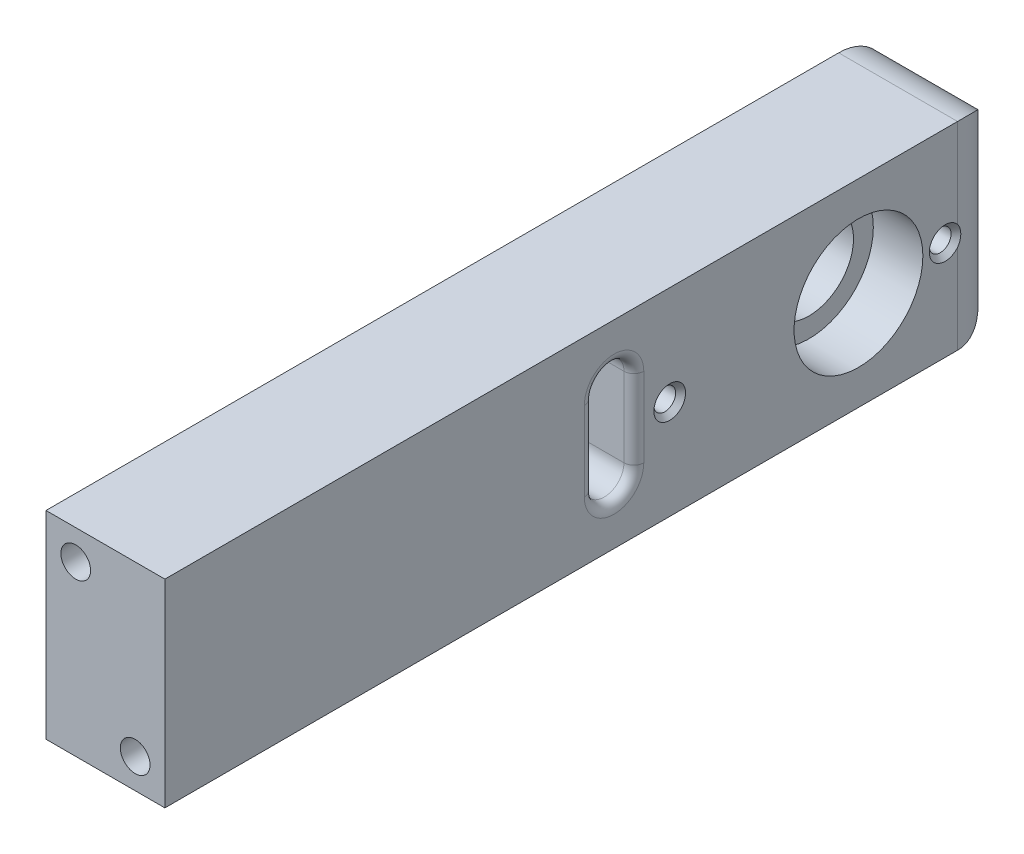
ISO-10303-21;
HEADER;
FILE_DESCRIPTION(('STEP AP214'),'2;1');
FILE_NAME('part.step','',(''),(''),'','','');
FILE_SCHEMA(('AUTOMOTIVE_DESIGN { 1 0 10303 214 1 1 1 1 }'));
ENDSEC;
DATA;
#1=APPLICATION_CONTEXT('core data for automotive mechanical design processes');
#2=APPLICATION_PROTOCOL_DEFINITION('international standard','automotive_design',2000,#1);
#3=PRODUCT_CONTEXT('',#1,'mechanical');
#4=PRODUCT('Part','Part','',(#3));
#5=PRODUCT_RELATED_PRODUCT_CATEGORY('part','',(#4));
#6=PRODUCT_DEFINITION_FORMATION('','',#4);
#7=PRODUCT_DEFINITION_CONTEXT('part definition',#1,'design');
#8=PRODUCT_DEFINITION('design','',#6,#7);
#9=PRODUCT_DEFINITION_SHAPE('','',#8);
#10=(LENGTH_UNIT() NAMED_UNIT(*) SI_UNIT(.MILLI.,.METRE.));
#11=(NAMED_UNIT(*) PLANE_ANGLE_UNIT() SI_UNIT($,.RADIAN.));
#12=(NAMED_UNIT(*) SI_UNIT($,.STERADIAN.) SOLID_ANGLE_UNIT());
#13=UNCERTAINTY_MEASURE_WITH_UNIT(LENGTH_MEASURE(1.E-05),#10,'distance_accuracy_value','');
#14=(GEOMETRIC_REPRESENTATION_CONTEXT(3) GLOBAL_UNCERTAINTY_ASSIGNED_CONTEXT((#13)) GLOBAL_UNIT_ASSIGNED_CONTEXT((#10,
#11,#12)) REPRESENTATION_CONTEXT('',''));
#15=CARTESIAN_POINT('',(0.,0.,0.));
#16=DIRECTION('',(0.,0.,1.));
#17=DIRECTION('',(1.,0.,0.));
#18=AXIS2_PLACEMENT_3D('',#15,#16,#17);
#19=CARTESIAN_POINT('',(6.,-10.,85.));
#20=DIRECTION('',(-1.,0.,0.));
#21=DIRECTION('',(0.,0.,1.));
#22=AXIS2_PLACEMENT_3D('',#19,#20,#21);
#23=PLANE('',#22);
#24=DIRECTION('',(0.,1.,0.));
#25=VECTOR('',#24,1.);
#26=CARTESIAN_POINT('',(6.,-10.,42.6680373510065));
#27=LINE('',#26,#25);
#28=CARTESIAN_POINT('',(6.,-4.,42.6680373510065));
#29=VERTEX_POINT('',#28);
#30=CARTESIAN_POINT('',(6.,4.,42.6680373510065));
#31=VERTEX_POINT('',#30);
#32=EDGE_CURVE('E50',#29,#31,#27,.T.);
#33=ORIENTED_EDGE('',*,*,#32,.T.);
#34=CARTESIAN_POINT('',(6.,4.,39.6680373510065));
#35=DIRECTION('',(-1.,0.,0.));
#36=DIRECTION('',(0.,0.,1.));
#37=AXIS2_PLACEMENT_3D('',#34,#35,#36);
#38=CIRCLE('',#37,3.);
#39=CARTESIAN_POINT('',(6.,4.,36.6680373510065));
#40=VERTEX_POINT('',#39);
#41=EDGE_CURVE('E355',#31,#40,#38,.T.);
#42=ORIENTED_EDGE('',*,*,#41,.T.);
#43=DIRECTION('',(0.,-1.,0.));
#44=VECTOR('',#43,1.);
#45=CARTESIAN_POINT('',(6.,-10.,36.6680373510065));
#46=LINE('',#45,#44);
#47=CARTESIAN_POINT('',(6.,-4.,36.6680373510065));
#48=VERTEX_POINT('',#47);
#49=EDGE_CURVE('E351',#40,#48,#46,.T.);
#50=ORIENTED_EDGE('',*,*,#49,.T.);
#51=CARTESIAN_POINT('',(6.,-4.,39.6680373510065));
#52=DIRECTION('',(-1.,0.,0.));
#53=DIRECTION('',(0.,0.,1.));
#54=AXIS2_PLACEMENT_3D('',#51,#52,#53);
#55=CIRCLE('',#54,3.);
#56=EDGE_CURVE('E55',#48,#29,#55,.T.);
#57=ORIENTED_EDGE('',*,*,#56,.T.);
#58=EDGE_LOOP('',(#33,#42,#50,#57));
#59=FACE_BOUND('',#58,.T.);
#60=DIRECTION('',(0.,0.,-1.));
#61=VECTOR('',#60,1.);
#62=CARTESIAN_POINT('',(6.,-10.,85.));
#63=LINE('',#62,#61);
#64=CARTESIAN_POINT('',(6.,-10.,85.));
#65=VERTEX_POINT('',#64);
#66=CARTESIAN_POINT('',(6.,-10.,5.));
#67=VERTEX_POINT('',#66);
#68=EDGE_CURVE('E301',#65,#67,#63,.T.);
#69=ORIENTED_EDGE('',*,*,#68,.T.);
#70=DIRECTION('',(0.,1.,0.));
#71=VECTOR('',#70,1.);
#72=CARTESIAN_POINT('',(6.,10.,5.));
#73=LINE('',#72,#71);
#74=CARTESIAN_POINT('',(6.,-0.998749217768657,5.));
#75=VERTEX_POINT('',#74);
#76=EDGE_CURVE('E190',#67,#75,#73,.T.);
#77=ORIENTED_EDGE('',*,*,#76,.T.);
#78=CARTESIAN_POINT('',(6.,2.39519381741592E-13,6.24999999999999));
#79=DIRECTION('',(-1.,0.,0.));
#80=DIRECTION('',(0.,0.,1.));
#81=AXIS2_PLACEMENT_3D('',#78,#79,#80);
#82=CIRCLE('',#81,1.59999999999811);
#83=CARTESIAN_POINT('',(6.,0.998749217769137,5.));
#84=VERTEX_POINT('',#83);
#85=EDGE_CURVE('E184',#75,#84,#82,.T.);
#86=ORIENTED_EDGE('',*,*,#85,.T.);
#87=DIRECTION('',(0.,1.,0.));
#88=VECTOR('',#87,1.);
#89=CARTESIAN_POINT('',(6.,10.,5.));
#90=LINE('',#89,#88);
#91=CARTESIAN_POINT('',(6.,10.,5.));
#92=VERTEX_POINT('',#91);
#93=EDGE_CURVE('E167',#84,#92,#90,.T.);
#94=ORIENTED_EDGE('',*,*,#93,.T.);
#95=DIRECTION('',(0.,0.,-1.));
#96=VECTOR('',#95,1.);
#97=CARTESIAN_POINT('',(6.,10.,85.));
#98=LINE('',#97,#96);
#99=CARTESIAN_POINT('',(6.,10.,85.));
#100=VERTEX_POINT('',#99);
#101=EDGE_CURVE('E146',#100,#92,#98,.T.);
#102=ORIENTED_EDGE('',*,*,#101,.F.);
#103=DIRECTION('',(0.,1.,0.));
#104=VECTOR('',#103,1.);
#105=CARTESIAN_POINT('',(6.,-10.,85.));
#106=LINE('',#105,#104);
#107=EDGE_CURVE('E153',#65,#100,#106,.T.);
#108=ORIENTED_EDGE('',*,*,#107,.F.);
#109=EDGE_LOOP('',(#69,#77,#86,#94,#102,#108));
#110=FACE_BOUND('',#109,.T.);
#111=CARTESIAN_POINT('',(6.,2.27657069782276E-13,34.05));
#112=DIRECTION('',(-1.,0.,0.));
#113=DIRECTION('',(0.,0.,1.));
#114=AXIS2_PLACEMENT_3D('',#111,#112,#113);
#115=CIRCLE('',#114,1.59999999999811);
#116=CARTESIAN_POINT('',(6.,2.27657069782276E-13,35.6499999999981));
#117=VERTEX_POINT('',#116);
#118=EDGE_CURVE('E168',#117,#117,#115,.T.);
#119=ORIENTED_EDGE('',*,*,#118,.T.);
#120=EDGE_LOOP('',(#119));
#121=FACE_BOUND('',#120,.T.);
#122=CARTESIAN_POINT('',(6.,0.,15.));
#123=DIRECTION('',(1.,0.,0.));
#124=DIRECTION('',(0.,0.,-1.));
#125=AXIS2_PLACEMENT_3D('',#122,#123,#124);
#126=CIRCLE('',#125,6.5);
#127=CARTESIAN_POINT('',(6.,0.,8.5));
#128=VERTEX_POINT('',#127);
#129=EDGE_CURVE('E179',#128,#128,#126,.T.);
#130=ORIENTED_EDGE('',*,*,#129,.F.);
#131=EDGE_LOOP('',(#130));
#132=FACE_BOUND('',#131,.T.);
#133=ADVANCED_FACE('F33',(#59,#110,#121,#132),#23,.F.);
#134=CARTESIAN_POINT('',(-6.,10.,85.));
#135=DIRECTION('',(0.,-1.,0.));
#136=DIRECTION('',(0.,0.,-1.));
#137=AXIS2_PLACEMENT_3D('',#134,#135,#136);
#138=PLANE('',#137);
#139=ORIENTED_EDGE('',*,*,#101,.T.);
#140=DIRECTION('',(-1.,0.,0.));
#141=VECTOR('',#140,1.);
#142=CARTESIAN_POINT('',(-6.,10.,5.));
#143=LINE('',#142,#141);
#144=CARTESIAN_POINT('',(-6.,10.,5.));
#145=VERTEX_POINT('',#144);
#146=EDGE_CURVE('E412',#92,#145,#143,.T.);
#147=ORIENTED_EDGE('',*,*,#146,.T.);
#148=DIRECTION('',(0.,0.,-1.));
#149=VECTOR('',#148,1.);
#150=CARTESIAN_POINT('',(-6.,10.,85.));
#151=LINE('',#150,#149);
#152=CARTESIAN_POINT('',(-6.,10.,85.));
#153=VERTEX_POINT('',#152);
#154=EDGE_CURVE('E149',#153,#145,#151,.T.);
#155=ORIENTED_EDGE('',*,*,#154,.F.);
#156=DIRECTION('',(-1.,0.,0.));
#157=VECTOR('',#156,1.);
#158=CARTESIAN_POINT('',(-6.,10.,85.));
#159=LINE('',#158,#157);
#160=EDGE_CURVE('E142',#100,#153,#159,.T.);
#161=ORIENTED_EDGE('',*,*,#160,.F.);
#162=EDGE_LOOP('',(#139,#147,#155,#161));
#163=FACE_BOUND('',#162,.T.);
#164=ADVANCED_FACE('F144',(#163),#138,.F.);
#165=CARTESIAN_POINT('',(-6.,-10.,85.));
#166=DIRECTION('',(1.,0.,0.));
#167=DIRECTION('',(0.,0.,-1.));
#168=AXIS2_PLACEMENT_3D('',#165,#166,#167);
#169=PLANE('',#168);
#170=CARTESIAN_POINT('',(-6.,4.,39.6680373510065));
#171=DIRECTION('',(1.,0.,0.));
#172=DIRECTION('',(0.,0.,-1.));
#173=AXIS2_PLACEMENT_3D('',#170,#171,#172);
#174=CIRCLE('',#173,3.);
#175=CARTESIAN_POINT('',(-6.,4.,36.6680373510065));
#176=VERTEX_POINT('',#175);
#177=CARTESIAN_POINT('',(-6.,4.,42.6680373510065));
#178=VERTEX_POINT('',#177);
#179=EDGE_CURVE('E334',#176,#178,#174,.T.);
#180=ORIENTED_EDGE('',*,*,#179,.T.);
#181=DIRECTION('',(0.,1.,0.));
#182=VECTOR('',#181,1.);
#183=CARTESIAN_POINT('',(-6.,-10.,42.6680373510065));
#184=LINE('',#183,#182);
#185=CARTESIAN_POINT('',(-6.,-4.,42.6680373510065));
#186=VERTEX_POINT('',#185);
#187=EDGE_CURVE('E340',#178,#186,#184,.F.);
#188=ORIENTED_EDGE('',*,*,#187,.T.);
#189=CARTESIAN_POINT('',(-6.,-4.,39.6680373510065));
#190=DIRECTION('',(1.,0.,0.));
#191=DIRECTION('',(0.,0.,-1.));
#192=AXIS2_PLACEMENT_3D('',#189,#190,#191);
#193=CIRCLE('',#192,3.);
#194=CARTESIAN_POINT('',(-6.,-4.,36.6680373510065));
#195=VERTEX_POINT('',#194);
#196=EDGE_CURVE('E338',#186,#195,#193,.T.);
#197=ORIENTED_EDGE('',*,*,#196,.T.);
#198=DIRECTION('',(0.,-1.,0.));
#199=VECTOR('',#198,1.);
#200=CARTESIAN_POINT('',(-6.,-10.,36.6680373510065));
#201=LINE('',#200,#199);
#202=EDGE_CURVE('E336',#195,#176,#201,.F.);
#203=ORIENTED_EDGE('',*,*,#202,.T.);
#204=EDGE_LOOP('',(#180,#188,#197,#203));
#205=FACE_BOUND('',#204,.T.);
#206=CARTESIAN_POINT('',(-6.,2.39519381741592E-13,6.24999999999999));
#207=DIRECTION('',(-1.,0.,0.));
#208=DIRECTION('',(0.,0.,1.));
#209=AXIS2_PLACEMENT_3D('',#206,#207,#208);
#210=CIRCLE('',#209,1.09999999999811);
#211=CARTESIAN_POINT('',(-6.,2.39519381741592E-13,7.3499999999981));
#212=VERTEX_POINT('',#211);
#213=EDGE_CURVE('E330',#212,#212,#210,.T.);
#214=ORIENTED_EDGE('',*,*,#213,.F.);
#215=EDGE_LOOP('',(#214));
#216=FACE_BOUND('',#215,.T.);
#217=CARTESIAN_POINT('',(-6.,2.27657069782276E-13,34.05));
#218=DIRECTION('',(-1.,0.,0.));
#219=DIRECTION('',(0.,0.,1.));
#220=AXIS2_PLACEMENT_3D('',#217,#218,#219);
#221=CIRCLE('',#220,1.0999999999981);
#222=CARTESIAN_POINT('',(-6.,2.27657069782276E-13,35.1499999999981));
#223=VERTEX_POINT('',#222);
#224=EDGE_CURVE('E400',#223,#223,#221,.T.);
#225=ORIENTED_EDGE('',*,*,#224,.F.);
#226=EDGE_LOOP('',(#225));
#227=FACE_BOUND('',#226,.T.);
#228=CARTESIAN_POINT('',(-6.,0.,15.));
#229=DIRECTION('',(-1.,0.,0.));
#230=DIRECTION('',(0.,0.,1.));
#231=AXIS2_PLACEMENT_3D('',#228,#229,#230);
#232=CIRCLE('',#231,4.5);
#233=CARTESIAN_POINT('',(-6.,0.,19.5));
#234=VERTEX_POINT('',#233);
#235=EDGE_CURVE('E180',#234,#234,#232,.T.);
#236=ORIENTED_EDGE('',*,*,#235,.F.);
#237=EDGE_LOOP('',(#236));
#238=FACE_BOUND('',#237,.T.);
#239=ORIENTED_EDGE('',*,*,#154,.T.);
#240=CARTESIAN_POINT('',(-6.,5.,5.));
#241=DIRECTION('',(1.,0.,0.));
#242=DIRECTION('',(0.,0.,-1.));
#243=AXIS2_PLACEMENT_3D('',#240,#241,#242);
#244=CIRCLE('',#243,5.);
#245=CARTESIAN_POINT('',(-6.,5.,0.));
#246=VERTEX_POINT('',#245);
#247=EDGE_CURVE('E319',#145,#246,#244,.F.);
#248=ORIENTED_EDGE('',*,*,#247,.T.);
#249=DIRECTION('',(0.,-1.,0.));
#250=VECTOR('',#249,1.);
#251=CARTESIAN_POINT('',(-6.,-10.,0.));
#252=LINE('',#251,#250);
#253=CARTESIAN_POINT('',(-6.,-5.,0.));
#254=VERTEX_POINT('',#253);
#255=EDGE_CURVE('E162',#246,#254,#252,.T.);
#256=ORIENTED_EDGE('',*,*,#255,.T.);
#257=CARTESIAN_POINT('',(-6.,-5.,5.));
#258=DIRECTION('',(1.,0.,0.));
#259=DIRECTION('',(0.,0.,-1.));
#260=AXIS2_PLACEMENT_3D('',#257,#258,#259);
#261=CIRCLE('',#260,5.);
#262=CARTESIAN_POINT('',(-6.,-10.,5.));
#263=VERTEX_POINT('',#262);
#264=EDGE_CURVE('E314',#254,#263,#261,.F.);
#265=ORIENTED_EDGE('',*,*,#264,.T.);
#266=DIRECTION('',(0.,0.,-1.));
#267=VECTOR('',#266,1.);
#268=CARTESIAN_POINT('',(-6.,-10.,85.));
#269=LINE('',#268,#267);
#270=CARTESIAN_POINT('',(-6.,-10.,85.));
#271=VERTEX_POINT('',#270);
#272=EDGE_CURVE('E173',#271,#263,#269,.T.);
#273=ORIENTED_EDGE('',*,*,#272,.F.);
#274=DIRECTION('',(0.,-1.,0.));
#275=VECTOR('',#274,1.);
#276=CARTESIAN_POINT('',(-6.,-10.,85.));
#277=LINE('',#276,#275);
#278=EDGE_CURVE('E152',#153,#271,#277,.T.);
#279=ORIENTED_EDGE('',*,*,#278,.F.);
#280=EDGE_LOOP('',(#239,#248,#256,#265,#273,#279));
#281=FACE_BOUND('',#280,.T.);
#282=ADVANCED_FACE('F257',(#205,#216,#227,#238,#281),#169,.F.);
#283=CARTESIAN_POINT('',(-6.,-10.,85.));
#284=DIRECTION('',(0.,1.,0.));
#285=DIRECTION('',(0.,0.,1.));
#286=AXIS2_PLACEMENT_3D('',#283,#284,#285);
#287=PLANE('',#286);
#288=ORIENTED_EDGE('',*,*,#272,.T.);
#289=DIRECTION('',(1.,0.,0.));
#290=VECTOR('',#289,1.);
#291=CARTESIAN_POINT('',(6.,-10.,5.));
#292=LINE('',#291,#290);
#293=EDGE_CURVE('E309',#263,#67,#292,.T.);
#294=ORIENTED_EDGE('',*,*,#293,.T.);
#295=ORIENTED_EDGE('',*,*,#68,.F.);
#296=DIRECTION('',(1.,0.,0.));
#297=VECTOR('',#296,1.);
#298=CARTESIAN_POINT('',(-6.,-10.,85.));
#299=LINE('',#298,#297);
#300=EDGE_CURVE('E158',#271,#65,#299,.T.);
#301=ORIENTED_EDGE('',*,*,#300,.F.);
#302=EDGE_LOOP('',(#288,#294,#295,#301));
#303=FACE_BOUND('',#302,.T.);
#304=ADVANCED_FACE('F308',(#303),#287,.F.);
#305=CARTESIAN_POINT('',(0.,0.,85.));
#306=DIRECTION('',(0.,0.,-1.));
#307=DIRECTION('',(-1.,0.,0.));
#308=AXIS2_PLACEMENT_3D('',#305,#306,#307);
#309=PLANE('',#308);
#310=CARTESIAN_POINT('',(-3.,7.,85.));
#311=DIRECTION('',(0.,0.,1.));
#312=DIRECTION('',(1.,0.,0.));
#313=AXIS2_PLACEMENT_3D('',#310,#311,#312);
#314=CIRCLE('',#313,1.5);
#315=CARTESIAN_POINT('',(-1.5,7.,85.));
#316=VERTEX_POINT('',#315);
#317=EDGE_CURVE('E291',#316,#316,#314,.T.);
#318=ORIENTED_EDGE('',*,*,#317,.F.);
#319=EDGE_LOOP('',(#318));
#320=FACE_BOUND('',#319,.T.);
#321=CARTESIAN_POINT('',(3.,-7.,85.));
#322=DIRECTION('',(0.,0.,1.));
#323=DIRECTION('',(1.,0.,0.));
#324=AXIS2_PLACEMENT_3D('',#321,#322,#323);
#325=CIRCLE('',#324,1.5);
#326=CARTESIAN_POINT('',(4.5,-7.,85.));
#327=VERTEX_POINT('',#326);
#328=EDGE_CURVE('E284',#327,#327,#325,.T.);
#329=ORIENTED_EDGE('',*,*,#328,.F.);
#330=EDGE_LOOP('',(#329));
#331=FACE_BOUND('',#330,.T.);
#332=ORIENTED_EDGE('',*,*,#107,.T.);
#333=ORIENTED_EDGE('',*,*,#160,.T.);
#334=ORIENTED_EDGE('',*,*,#278,.T.);
#335=ORIENTED_EDGE('',*,*,#300,.T.);
#336=EDGE_LOOP('',(#332,#333,#334,#335));
#337=FACE_BOUND('',#336,.T.);
#338=ADVANCED_FACE('F156',(#320,#331,#337),#309,.F.);
#339=CARTESIAN_POINT('',(0.,0.,0.));
#340=DIRECTION('',(0.,0.,-1.));
#341=DIRECTION('',(-1.,0.,0.));
#342=AXIS2_PLACEMENT_3D('',#339,#340,#341);
#343=PLANE('',#342);
#344=ORIENTED_EDGE('',*,*,#255,.F.);
#345=DIRECTION('',(-1.,0.,0.));
#346=VECTOR('',#345,1.);
#347=CARTESIAN_POINT('',(6.,5.,0.));
#348=LINE('',#347,#346);
#349=CARTESIAN_POINT('',(0.999999999999998,5.,0.));
#350=VERTEX_POINT('',#349);
#351=EDGE_CURVE('E413',#246,#350,#348,.F.);
#352=ORIENTED_EDGE('',*,*,#351,.T.);
#353=DIRECTION('',(0.,1.,0.));
#354=VECTOR('',#353,1.);
#355=CARTESIAN_POINT('',(0.999999999999998,-10.,0.));
#356=LINE('',#355,#354);
#357=CARTESIAN_POINT('',(0.999999999999998,-5.,0.));
#358=VERTEX_POINT('',#357);
#359=EDGE_CURVE('E416',#350,#358,#356,.F.);
#360=ORIENTED_EDGE('',*,*,#359,.T.);
#361=DIRECTION('',(1.,0.,0.));
#362=VECTOR('',#361,1.);
#363=CARTESIAN_POINT('',(-6.,-5.,0.));
#364=LINE('',#363,#362);
#365=EDGE_CURVE('E201',#358,#254,#364,.F.);
#366=ORIENTED_EDGE('',*,*,#365,.T.);
#367=EDGE_LOOP('',(#344,#352,#360,#366));
#368=FACE_BOUND('',#367,.T.);
#369=ADVANCED_FACE('F419',(#368),#343,.T.);
#370=CARTESIAN_POINT('',(3.,-7.,75.));
#371=DIRECTION('',(0.,0.,1.));
#372=DIRECTION('',(1.,0.,0.));
#373=AXIS2_PLACEMENT_3D('',#370,#371,#372);
#374=CYLINDRICAL_SURFACE('',#373,1.5);
#375=CARTESIAN_POINT('',(3.,-7.,75.));
#376=DIRECTION('',(0.,0.,1.));
#377=DIRECTION('',(1.,0.,0.));
#378=AXIS2_PLACEMENT_3D('',#375,#376,#377);
#379=CIRCLE('',#378,1.5);
#380=CARTESIAN_POINT('',(4.5,-7.,75.));
#381=VERTEX_POINT('',#380);
#382=EDGE_CURVE('E294',#381,#381,#379,.T.);
#383=ORIENTED_EDGE('',*,*,#382,.F.);
#384=EDGE_LOOP('',(#383));
#385=FACE_BOUND('',#384,.T.);
#386=ORIENTED_EDGE('',*,*,#328,.T.);
#387=EDGE_LOOP('',(#386));
#388=FACE_BOUND('',#387,.T.);
#389=ADVANCED_FACE('F605',(#385,#388),#374,.F.);
#390=CARTESIAN_POINT('',(3.,-7.,75.));
#391=DIRECTION('',(0.,0.,1.));
#392=DIRECTION('',(1.,0.,0.));
#393=AXIS2_PLACEMENT_3D('',#390,#391,#392);
#394=PLANE('',#393);
#395=ORIENTED_EDGE('',*,*,#382,.T.);
#396=EDGE_LOOP('',(#395));
#397=FACE_BOUND('',#396,.T.);
#398=ADVANCED_FACE('F596',(#397),#394,.T.);
#399=CARTESIAN_POINT('',(-3.,7.,75.));
#400=DIRECTION('',(0.,0.,1.));
#401=DIRECTION('',(1.,0.,0.));
#402=AXIS2_PLACEMENT_3D('',#399,#400,#401);
#403=CYLINDRICAL_SURFACE('',#402,1.5);
#404=CARTESIAN_POINT('',(-3.,7.,75.));
#405=DIRECTION('',(0.,0.,1.));
#406=DIRECTION('',(1.,0.,0.));
#407=AXIS2_PLACEMENT_3D('',#404,#405,#406);
#408=CIRCLE('',#407,1.5);
#409=CARTESIAN_POINT('',(-1.5,7.,75.));
#410=VERTEX_POINT('',#409);
#411=EDGE_CURVE('E288',#410,#410,#408,.T.);
#412=ORIENTED_EDGE('',*,*,#411,.F.);
#413=EDGE_LOOP('',(#412));
#414=FACE_BOUND('',#413,.T.);
#415=ORIENTED_EDGE('',*,*,#317,.T.);
#416=EDGE_LOOP('',(#415));
#417=FACE_BOUND('',#416,.T.);
#418=ADVANCED_FACE('F587',(#414,#417),#403,.F.);
#419=CARTESIAN_POINT('',(-3.,7.,75.));
#420=DIRECTION('',(0.,0.,1.));
#421=DIRECTION('',(1.,0.,0.));
#422=AXIS2_PLACEMENT_3D('',#419,#420,#421);
#423=PLANE('',#422);
#424=ORIENTED_EDGE('',*,*,#411,.T.);
#425=EDGE_LOOP('',(#424));
#426=FACE_BOUND('',#425,.T.);
#427=ADVANCED_FACE('F578',(#426),#423,.T.);
#428=CARTESIAN_POINT('',(0.999999999999998,0.,15.));
#429=DIRECTION('',(1.,0.,0.));
#430=DIRECTION('',(0.,0.,-1.));
#431=AXIS2_PLACEMENT_3D('',#428,#429,#430);
#432=CYLINDRICAL_SURFACE('',#431,6.5);
#433=CARTESIAN_POINT('',(0.999999999999998,0.,15.));
#434=DIRECTION('',(1.,0.,0.));
#435=DIRECTION('',(0.,0.,-1.));
#436=AXIS2_PLACEMENT_3D('',#433,#434,#435);
#437=CIRCLE('',#436,6.5);
#438=CARTESIAN_POINT('',(0.999999999999998,0.,8.5));
#439=VERTEX_POINT('',#438);
#440=EDGE_CURVE('E281',#439,#439,#437,.T.);
#441=ORIENTED_EDGE('',*,*,#440,.F.);
#442=EDGE_LOOP('',(#441));
#443=FACE_BOUND('',#442,.T.);
#444=ORIENTED_EDGE('',*,*,#129,.T.);
#445=EDGE_LOOP('',(#444));
#446=FACE_BOUND('',#445,.T.);
#447=ADVANCED_FACE('F569',(#443,#446),#432,.F.);
#448=CARTESIAN_POINT('',(0.999999999999998,0.,15.));
#449=DIRECTION('',(1.,0.,0.));
#450=DIRECTION('',(0.,0.,-1.));
#451=AXIS2_PLACEMENT_3D('',#448,#449,#450);
#452=PLANE('',#451);
#453=CARTESIAN_POINT('',(0.999999999999998,0.,15.));
#454=DIRECTION('',(1.,0.,0.));
#455=DIRECTION('',(0.,0.,-1.));
#456=AXIS2_PLACEMENT_3D('',#453,#454,#455);
#457=CIRCLE('',#456,4.5);
#458=CARTESIAN_POINT('',(0.999999999999998,0.,10.5));
#459=VERTEX_POINT('',#458);
#460=EDGE_CURVE('E177',#459,#459,#457,.T.);
#461=ORIENTED_EDGE('',*,*,#460,.F.);
#462=EDGE_LOOP('',(#461));
#463=FACE_BOUND('',#462,.T.);
#464=ORIENTED_EDGE('',*,*,#440,.T.);
#465=EDGE_LOOP('',(#464));
#466=FACE_BOUND('',#465,.T.);
#467=ADVANCED_FACE('F560',(#463,#466),#452,.T.);
#468=CARTESIAN_POINT('',(6.,0.,15.));
#469=DIRECTION('',(-1.,0.,0.));
#470=DIRECTION('',(0.,0.,1.));
#471=AXIS2_PLACEMENT_3D('',#468,#469,#470);
#472=CYLINDRICAL_SURFACE('',#471,4.5);
#473=ORIENTED_EDGE('',*,*,#460,.T.);
#474=EDGE_LOOP('',(#473));
#475=FACE_BOUND('',#474,.T.);
#476=ORIENTED_EDGE('',*,*,#235,.T.);
#477=EDGE_LOOP('',(#476));
#478=FACE_BOUND('',#477,.T.);
#479=ADVANCED_FACE('F271',(#475,#478),#472,.F.);
#480=CARTESIAN_POINT('',(6.,2.27657069782276E-13,34.05));
#481=DIRECTION('',(-1.,0.,0.));
#482=DIRECTION('',(0.,0.,1.));
#483=AXIS2_PLACEMENT_3D('',#480,#481,#482);
#484=CYLINDRICAL_SURFACE('',#483,1.0999999999981);
#485=CARTESIAN_POINT('',(5.49999999999999,2.27657069782276E-13,34.05));
#486=DIRECTION('',(-1.,0.,0.));
#487=DIRECTION('',(0.,0.,1.));
#488=AXIS2_PLACEMENT_3D('',#485,#486,#487);
#489=CIRCLE('',#488,1.0999999999981);
#490=CARTESIAN_POINT('',(5.49999999999999,2.27657069782276E-13,35.1499999999981));
#491=VERTEX_POINT('',#490);
#492=EDGE_CURVE('E171',#491,#491,#489,.F.);
#493=ORIENTED_EDGE('',*,*,#492,.T.);
#494=EDGE_LOOP('',(#493));
#495=FACE_BOUND('',#494,.T.);
#496=ORIENTED_EDGE('',*,*,#224,.T.);
#497=EDGE_LOOP('',(#496));
#498=FACE_BOUND('',#497,.T.);
#499=ADVANCED_FACE('F263',(#495,#498),#484,.F.);
#500=CARTESIAN_POINT('',(6.,2.27657069782276E-13,34.05));
#501=DIRECTION('',(1.,0.,0.));
#502=DIRECTION('',(0.,0.,-1.));
#503=AXIS2_PLACEMENT_3D('',#500,#501,#502);
#504=CONICAL_SURFACE('',#503,1.59999999999811,0.785398163397451);
#505=ORIENTED_EDGE('',*,*,#492,.F.);
#506=EDGE_LOOP('',(#505));
#507=FACE_BOUND('',#506,.T.);
#508=ORIENTED_EDGE('',*,*,#118,.F.);
#509=EDGE_LOOP('',(#508));
#510=FACE_BOUND('',#509,.T.);
#511=ADVANCED_FACE('F260',(#507,#510),#504,.F.);
#512=CARTESIAN_POINT('',(6.,2.39519381741592E-13,6.24999999999999));
#513=DIRECTION('',(-1.,0.,0.));
#514=DIRECTION('',(0.,0.,1.));
#515=AXIS2_PLACEMENT_3D('',#512,#513,#514);
#516=CYLINDRICAL_SURFACE('',#515,1.09999999999811);
#517=CARTESIAN_POINT('',(5.49999999999999,2.39519381741592E-13,6.24999999999999));
#518=DIRECTION('',(-1.,0.,0.));
#519=DIRECTION('',(0.,0.,1.));
#520=AXIS2_PLACEMENT_3D('',#517,#518,#519);
#521=CIRCLE('',#520,1.09999999999811);
#522=CARTESIAN_POINT('',(5.49999999999999,2.39519381741592E-13,7.3499999999981));
#523=VERTEX_POINT('',#522);
#524=EDGE_CURVE('E186',#523,#523,#521,.F.);
#525=ORIENTED_EDGE('',*,*,#524,.T.);
#526=EDGE_LOOP('',(#525));
#527=FACE_BOUND('',#526,.T.);
#528=ORIENTED_EDGE('',*,*,#213,.T.);
#529=EDGE_LOOP('',(#528));
#530=FACE_BOUND('',#529,.T.);
#531=ADVANCED_FACE('F262',(#527,#530),#516,.F.);
#532=CARTESIAN_POINT('',(6.,2.39519381741592E-13,6.24999999999999));
#533=DIRECTION('',(1.,0.,0.));
#534=DIRECTION('',(0.,0.,-1.));
#535=AXIS2_PLACEMENT_3D('',#532,#533,#534);
#536=CONICAL_SURFACE('',#535,1.59999999999811,0.785398163397438);
#537=ORIENTED_EDGE('',*,*,#524,.F.);
#538=EDGE_LOOP('',(#537));
#539=FACE_BOUND('',#538,.T.);
#540=ORIENTED_EDGE('',*,*,#85,.F.);
#541=CARTESIAN_POINT('',(6.,-0.998749217768657,5.));
#542=CARTESIAN_POINT('',(5.99996642363082,-0.93652041003576,4.95027228118047));
#543=CARTESIAN_POINT('',(5.99925686960284,-0.870234479991113,4.90587239828447));
#544=CARTESIAN_POINT('',(5.99720324998498,-0.731734462346923,4.82807389984057));
#545=CARTESIAN_POINT('',(5.99586103910625,-0.65953820948366,4.79464360833746));
#546=CARTESIAN_POINT('',(5.99316311420849,-0.506014516052677,4.73695750659191));
#547=CARTESIAN_POINT('',(5.99181258346115,-0.424399589514403,4.71347159867067));
#548=CARTESIAN_POINT('',(5.9897241259861,-0.25845572458643,4.67913649339246));
#549=CARTESIAN_POINT('',(5.98898704495967,-0.174123205431982,4.66830473276082));
#550=CARTESIAN_POINT('',(5.98835633426123,0.00352562918565908,4.6589244475938));
#551=CARTESIAN_POINT('',(5.98855222030108,0.0969141145516046,4.66168047919336));
#552=CARTESIAN_POINT('',(5.98991957864924,0.281873101965019,4.68249899248508));
#553=CARTESIAN_POINT('',(5.99109037032761,0.373444826731111,4.70055079559557));
#554=CARTESIAN_POINT('',(5.99402696401461,0.559665600428214,4.75407053275533));
#555=CARTESIAN_POINT('',(5.9958336906092,0.653951079649901,4.79084542954131));
#556=CARTESIAN_POINT('',(5.99806973399123,0.78880542559283,4.85925073012382));
#557=CARTESIAN_POINT('',(5.99873723422624,0.832771434064094,4.88434585476668));
#558=CARTESIAN_POINT('',(5.99970072577354,0.917956507392878,4.93891040408376));
#559=CARTESIAN_POINT('',(5.99999637517512,0.959173011206224,4.96838382673568));
#560=CARTESIAN_POINT('',(6.00000000000002,0.998749217769148,4.99999999999996));
#561=B_SPLINE_CURVE_WITH_KNOTS('',3,(#541,#542,#543,#544,#545,#546,#547,#548,#549,#550,#551,
#552,#553,#554,#555,#556,#557,#558,#559,#560),.UNSPECIFIED.,.F.,.F.,(4,2,2,2,2,2,2,2,2,4),(0.,
0.238464354070946,0.476233927808509,0.730023548042194,0.984162465594595,1.26315002102226,
1.54194296455554,1.84360117872913,1.9952549800938,2.14704812293221),.UNSPECIFIED.);
#562=EDGE_CURVE('E193',#75,#84,#561,.T.);
#563=ORIENTED_EDGE('',*,*,#562,.T.);
#564=EDGE_LOOP('',(#540,#563));
#565=FACE_BOUND('',#564,.T.);
#566=ADVANCED_FACE('F203',(#539,#565),#536,.F.);
#567=CARTESIAN_POINT('',(-6.,-5.,5.));
#568=DIRECTION('',(-1.,0.,0.));
#569=DIRECTION('',(0.,0.,1.));
#570=AXIS2_PLACEMENT_3D('',#567,#568,#569);
#571=CYLINDRICAL_SURFACE('',#570,5.);
#572=ORIENTED_EDGE('',*,*,#264,.F.);
#573=ORIENTED_EDGE('',*,*,#365,.F.);
#574=CARTESIAN_POINT('',(0.999999999999998,-5.,5.));
#575=DIRECTION('',(-0.707106781186547,-0.707106781186547,0.));
#576=DIRECTION('',(-0.707106781186547,0.707106781186547,0.));
#577=AXIS2_PLACEMENT_3D('',#574,#575,#576);
#578=ELLIPSE('',#577,7.07106781186547,5.);
#579=EDGE_CURVE('E316',#67,#358,#578,.F.);
#580=ORIENTED_EDGE('',*,*,#579,.F.);
#581=ORIENTED_EDGE('',*,*,#293,.F.);
#582=EDGE_LOOP('',(#572,#573,#580,#581));
#583=FACE_BOUND('',#582,.T.);
#584=ADVANCED_FACE('F215',(#583),#571,.T.);
#585=CARTESIAN_POINT('',(-6.,5.,5.));
#586=DIRECTION('',(1.,0.,0.));
#587=DIRECTION('',(0.,0.,-1.));
#588=AXIS2_PLACEMENT_3D('',#585,#586,#587);
#589=CYLINDRICAL_SURFACE('',#588,5.);
#590=ORIENTED_EDGE('',*,*,#247,.F.);
#591=ORIENTED_EDGE('',*,*,#146,.F.);
#592=CARTESIAN_POINT('',(0.999999999999998,5.,5.));
#593=DIRECTION('',(0.707106781186547,-0.707106781186547,0.));
#594=DIRECTION('',(0.707106781186547,0.707106781186547,0.));
#595=AXIS2_PLACEMENT_3D('',#592,#593,#594);
#596=ELLIPSE('',#595,7.07106781186547,5.);
#597=EDGE_CURVE('E326',#350,#92,#596,.T.);
#598=ORIENTED_EDGE('',*,*,#597,.F.);
#599=ORIENTED_EDGE('',*,*,#351,.F.);
#600=EDGE_LOOP('',(#590,#591,#598,#599));
#601=FACE_BOUND('',#600,.T.);
#602=ADVANCED_FACE('F211',(#601),#589,.T.);
#603=CARTESIAN_POINT('',(0.999999999999998,-10.,5.));
#604=DIRECTION('',(0.,-1.,0.));
#605=DIRECTION('',(0.,0.,-1.));
#606=AXIS2_PLACEMENT_3D('',#603,#604,#605);
#607=CYLINDRICAL_SURFACE('',#606,5.);
#608=ORIENTED_EDGE('',*,*,#579,.T.);
#609=ORIENTED_EDGE('',*,*,#359,.F.);
#610=ORIENTED_EDGE('',*,*,#597,.T.);
#611=ORIENTED_EDGE('',*,*,#93,.F.);
#612=ORIENTED_EDGE('',*,*,#562,.F.);
#613=ORIENTED_EDGE('',*,*,#76,.F.);
#614=EDGE_LOOP('',(#608,#609,#610,#611,#612,#613));
#615=FACE_BOUND('',#614,.T.);
#616=ADVANCED_FACE('F206',(#615),#607,.T.);
#617=CARTESIAN_POINT('',(6.,-4.,39.6680373510065));
#618=DIRECTION('',(-1.,0.,0.));
#619=DIRECTION('',(0.,0.,1.));
#620=AXIS2_PLACEMENT_3D('',#617,#618,#619);
#621=CYLINDRICAL_SURFACE('',#620,2.);
#622=DIRECTION('',(-1.,0.,0.));
#623=VECTOR('',#622,1.);
#624=CARTESIAN_POINT('',(6.,-4.,37.6680373510065));
#625=LINE('',#624,#623);
#626=CARTESIAN_POINT('',(5.,-4.,37.6680373510065));
#627=VERTEX_POINT('',#626);
#628=CARTESIAN_POINT('',(-5.,-4.,37.6680373510065));
#629=VERTEX_POINT('',#628);
#630=EDGE_CURVE('E329',#627,#629,#625,.T.);
#631=ORIENTED_EDGE('',*,*,#630,.T.);
#632=CARTESIAN_POINT('',(-5.,-4.,39.6680373510065));
#633=DIRECTION('',(1.,0.,0.));
#634=DIRECTION('',(0.,0.,-1.));
#635=AXIS2_PLACEMENT_3D('',#632,#633,#634);
#636=CIRCLE('',#635,2.);
#637=CARTESIAN_POINT('',(-5.,-4.,41.6680373510065));
#638=VERTEX_POINT('',#637);
#639=EDGE_CURVE('E345',#629,#638,#636,.F.);
#640=ORIENTED_EDGE('',*,*,#639,.T.);
#641=DIRECTION('',(-1.,0.,0.));
#642=VECTOR('',#641,1.);
#643=CARTESIAN_POINT('',(6.,-4.,41.6680373510065));
#644=LINE('',#643,#642);
#645=CARTESIAN_POINT('',(5.,-4.,41.6680373510065));
#646=VERTEX_POINT('',#645);
#647=EDGE_CURVE('E368',#646,#638,#644,.T.);
#648=ORIENTED_EDGE('',*,*,#647,.F.);
#649=CARTESIAN_POINT('',(5.,-4.,39.6680373510065));
#650=DIRECTION('',(-1.,0.,0.));
#651=DIRECTION('',(0.,0.,1.));
#652=AXIS2_PLACEMENT_3D('',#649,#650,#651);
#653=CIRCLE('',#652,2.);
#654=EDGE_CURVE('E343',#646,#627,#653,.F.);
#655=ORIENTED_EDGE('',*,*,#654,.T.);
#656=EDGE_LOOP('',(#631,#640,#648,#655));
#657=FACE_BOUND('',#656,.T.);
#658=ADVANCED_FACE('F210',(#657),#621,.F.);
#659=CARTESIAN_POINT('',(6.,-4.,37.6680373510065));
#660=DIRECTION('',(0.,0.,-1.));
#661=DIRECTION('',(-1.,0.,0.));
#662=AXIS2_PLACEMENT_3D('',#659,#660,#661);
#663=PLANE('',#662);
#664=DIRECTION('',(-1.,0.,0.));
#665=VECTOR('',#664,1.);
#666=CARTESIAN_POINT('',(6.,4.,37.6680373510065));
#667=LINE('',#666,#665);
#668=CARTESIAN_POINT('',(5.,4.,37.6680373510065));
#669=VERTEX_POINT('',#668);
#670=CARTESIAN_POINT('',(-5.,4.,37.6680373510065));
#671=VERTEX_POINT('',#670);
#672=EDGE_CURVE('E390',#669,#671,#667,.T.);
#673=ORIENTED_EDGE('',*,*,#672,.T.);
#674=DIRECTION('',(0.,-1.,0.));
#675=VECTOR('',#674,1.);
#676=CARTESIAN_POINT('',(-5.,-4.,37.6680373510065));
#677=LINE('',#676,#675);
#678=EDGE_CURVE('E349',#671,#629,#677,.T.);
#679=ORIENTED_EDGE('',*,*,#678,.T.);
#680=ORIENTED_EDGE('',*,*,#630,.F.);
#681=DIRECTION('',(0.,-1.,0.));
#682=VECTOR('',#681,1.);
#683=CARTESIAN_POINT('',(5.,-4.,37.6680373510065));
#684=LINE('',#683,#682);
#685=EDGE_CURVE('E347',#627,#669,#684,.F.);
#686=ORIENTED_EDGE('',*,*,#685,.T.);
#687=EDGE_LOOP('',(#673,#679,#680,#686));
#688=FACE_BOUND('',#687,.T.);
#689=ADVANCED_FACE('F387',(#688),#663,.F.);
#690=CARTESIAN_POINT('',(6.,4.,39.6680373510065));
#691=DIRECTION('',(-1.,0.,0.));
#692=DIRECTION('',(0.,0.,1.));
#693=AXIS2_PLACEMENT_3D('',#690,#691,#692);
#694=CYLINDRICAL_SURFACE('',#693,2.);
#695=ORIENTED_EDGE('',*,*,#672,.F.);
#696=CARTESIAN_POINT('',(5.,4.,39.6680373510065));
#697=DIRECTION('',(-1.,0.,0.));
#698=DIRECTION('',(0.,0.,1.));
#699=AXIS2_PLACEMENT_3D('',#696,#697,#698);
#700=CIRCLE('',#699,2.);
#701=CARTESIAN_POINT('',(5.,4.,41.6680373510065));
#702=VERTEX_POINT('',#701);
#703=EDGE_CURVE('E11',#669,#702,#700,.F.);
#704=ORIENTED_EDGE('',*,*,#703,.T.);
#705=DIRECTION('',(-1.,0.,0.));
#706=VECTOR('',#705,1.);
#707=CARTESIAN_POINT('',(6.,4.,41.6680373510065));
#708=LINE('',#707,#706);
#709=CARTESIAN_POINT('',(-5.,4.,41.6680373510065));
#710=VERTEX_POINT('',#709);
#711=EDGE_CURVE('E392',#702,#710,#708,.T.);
#712=ORIENTED_EDGE('',*,*,#711,.T.);
#713=CARTESIAN_POINT('',(-5.,4.,39.6680373510065));
#714=DIRECTION('',(1.,0.,0.));
#715=DIRECTION('',(0.,0.,-1.));
#716=AXIS2_PLACEMENT_3D('',#713,#714,#715);
#717=CIRCLE('',#716,2.);
#718=EDGE_CURVE('E42',#710,#671,#717,.F.);
#719=ORIENTED_EDGE('',*,*,#718,.T.);
#720=EDGE_LOOP('',(#695,#704,#712,#719));
#721=FACE_BOUND('',#720,.T.);
#722=ADVANCED_FACE('F461',(#721),#694,.F.);
#723=CARTESIAN_POINT('',(6.,-4.,41.6680373510065));
#724=DIRECTION('',(0.,0.,1.));
#725=DIRECTION('',(1.,0.,0.));
#726=AXIS2_PLACEMENT_3D('',#723,#724,#725);
#727=PLANE('',#726);
#728=ORIENTED_EDGE('',*,*,#647,.T.);
#729=DIRECTION('',(0.,1.,0.));
#730=VECTOR('',#729,1.);
#731=CARTESIAN_POINT('',(-5.,-4.,41.6680373510065));
#732=LINE('',#731,#730);
#733=EDGE_CURVE('E321',#638,#710,#732,.T.);
#734=ORIENTED_EDGE('',*,*,#733,.T.);
#735=ORIENTED_EDGE('',*,*,#711,.F.);
#736=DIRECTION('',(0.,1.,0.));
#737=VECTOR('',#736,1.);
#738=CARTESIAN_POINT('',(5.,-4.,41.6680373510065));
#739=LINE('',#738,#737);
#740=EDGE_CURVE('E318',#702,#646,#739,.F.);
#741=ORIENTED_EDGE('',*,*,#740,.T.);
#742=EDGE_LOOP('',(#728,#734,#735,#741));
#743=FACE_BOUND('',#742,.T.);
#744=ADVANCED_FACE('F235',(#743),#727,.F.);
#745=CARTESIAN_POINT('',(-5.,-4.,36.6680373510065));
#746=DIRECTION('',(0.,-1.,0.));
#747=DIRECTION('',(0.,0.,-1.));
#748=AXIS2_PLACEMENT_3D('',#745,#746,#747);
#749=CYLINDRICAL_SURFACE('',#748,1.);
#750=CARTESIAN_POINT('',(-5.,4.,36.6680373510065));
#751=DIRECTION('',(0.,1.,0.));
#752=DIRECTION('',(0.,0.,1.));
#753=AXIS2_PLACEMENT_3D('',#750,#751,#752);
#754=CIRCLE('',#753,1.);
#755=EDGE_CURVE('E362',#176,#671,#754,.T.);
#756=ORIENTED_EDGE('',*,*,#755,.F.);
#757=ORIENTED_EDGE('',*,*,#202,.F.);
#758=CARTESIAN_POINT('',(-5.,-4.,36.6680373510065));
#759=DIRECTION('',(0.,-1.,0.));
#760=DIRECTION('',(0.,0.,-1.));
#761=AXIS2_PLACEMENT_3D('',#758,#759,#760);
#762=CIRCLE('',#761,1.);
#763=EDGE_CURVE('E365',#629,#195,#762,.T.);
#764=ORIENTED_EDGE('',*,*,#763,.F.);
#765=ORIENTED_EDGE('',*,*,#678,.F.);
#766=EDGE_LOOP('',(#756,#757,#764,#765));
#767=FACE_BOUND('',#766,.T.);
#768=ADVANCED_FACE('F231',(#767),#749,.T.);
#769=CARTESIAN_POINT('',(-5.,-4.,39.6680373510065));
#770=DIRECTION('',(1.,0.,0.));
#771=DIRECTION('',(0.,0.,-1.));
#772=AXIS2_PLACEMENT_3D('',#769,#770,#771);
#773=TOROIDAL_SURFACE('',#772,3.,1.);
#774=ORIENTED_EDGE('',*,*,#763,.T.);
#775=ORIENTED_EDGE('',*,*,#196,.F.);
#776=CARTESIAN_POINT('',(-5.,-4.,42.6680373510065));
#777=DIRECTION('',(0.,1.,0.));
#778=DIRECTION('',(0.,0.,1.));
#779=AXIS2_PLACEMENT_3D('',#776,#777,#778);
#780=CIRCLE('',#779,1.);
#781=EDGE_CURVE('E360',#638,#186,#780,.T.);
#782=ORIENTED_EDGE('',*,*,#781,.F.);
#783=ORIENTED_EDGE('',*,*,#639,.F.);
#784=EDGE_LOOP('',(#774,#775,#782,#783));
#785=FACE_BOUND('',#784,.T.);
#786=ADVANCED_FACE('F227',(#785),#773,.T.);
#787=CARTESIAN_POINT('',(-5.,4.,39.6680373510065));
#788=DIRECTION('',(1.,0.,0.));
#789=DIRECTION('',(0.,0.,-1.));
#790=AXIS2_PLACEMENT_3D('',#787,#788,#789);
#791=TOROIDAL_SURFACE('',#790,3.,1.);
#792=ORIENTED_EDGE('',*,*,#755,.T.);
#793=ORIENTED_EDGE('',*,*,#718,.F.);
#794=CARTESIAN_POINT('',(-5.,4.,42.6680373510065));
#795=DIRECTION('',(0.,-1.,0.));
#796=DIRECTION('',(0.,0.,-1.));
#797=AXIS2_PLACEMENT_3D('',#794,#795,#796);
#798=CIRCLE('',#797,1.);
#799=EDGE_CURVE('E358',#178,#710,#798,.T.);
#800=ORIENTED_EDGE('',*,*,#799,.F.);
#801=ORIENTED_EDGE('',*,*,#179,.F.);
#802=EDGE_LOOP('',(#792,#793,#800,#801));
#803=FACE_BOUND('',#802,.T.);
#804=ADVANCED_FACE('F223',(#803),#791,.T.);
#805=CARTESIAN_POINT('',(-5.,-4.,42.6680373510065));
#806=DIRECTION('',(0.,1.,0.));
#807=DIRECTION('',(0.,0.,1.));
#808=AXIS2_PLACEMENT_3D('',#805,#806,#807);
#809=CYLINDRICAL_SURFACE('',#808,1.);
#810=ORIENTED_EDGE('',*,*,#781,.T.);
#811=ORIENTED_EDGE('',*,*,#187,.F.);
#812=ORIENTED_EDGE('',*,*,#799,.T.);
#813=ORIENTED_EDGE('',*,*,#733,.F.);
#814=EDGE_LOOP('',(#810,#811,#812,#813));
#815=FACE_BOUND('',#814,.T.);
#816=ADVANCED_FACE('F220',(#815),#809,.T.);
#817=CARTESIAN_POINT('',(5.,-4.,39.6680373510065));
#818=DIRECTION('',(-1.,0.,0.));
#819=DIRECTION('',(0.,0.,1.));
#820=AXIS2_PLACEMENT_3D('',#817,#818,#819);
#821=TOROIDAL_SURFACE('',#820,3.,1.);
#822=CARTESIAN_POINT('',(5.,-4.,36.6680373510065));
#823=DIRECTION('',(0.,1.,0.));
#824=DIRECTION('',(0.,0.,1.));
#825=AXIS2_PLACEMENT_3D('',#822,#823,#824);
#826=CIRCLE('',#825,1.);
#827=EDGE_CURVE('E372',#627,#48,#826,.T.);
#828=ORIENTED_EDGE('',*,*,#827,.F.);
#829=ORIENTED_EDGE('',*,*,#654,.F.);
#830=CARTESIAN_POINT('',(5.,-4.,42.6680373510065));
#831=DIRECTION('',(0.,1.,0.));
#832=DIRECTION('',(0.,0.,1.));
#833=AXIS2_PLACEMENT_3D('',#830,#831,#832);
#834=CIRCLE('',#833,1.);
#835=EDGE_CURVE('E37',#29,#646,#834,.T.);
#836=ORIENTED_EDGE('',*,*,#835,.F.);
#837=ORIENTED_EDGE('',*,*,#56,.F.);
#838=EDGE_LOOP('',(#828,#829,#836,#837));
#839=FACE_BOUND('',#838,.T.);
#840=ADVANCED_FACE('F35',(#839),#821,.T.);
#841=CARTESIAN_POINT('',(5.,-10.,42.6680373510065));
#842=DIRECTION('',(0.,1.,0.));
#843=DIRECTION('',(0.,0.,1.));
#844=AXIS2_PLACEMENT_3D('',#841,#842,#843);
#845=CYLINDRICAL_SURFACE('',#844,1.);
#846=ORIENTED_EDGE('',*,*,#835,.T.);
#847=ORIENTED_EDGE('',*,*,#740,.F.);
#848=CARTESIAN_POINT('',(5.,4.,42.6680373510065));
#849=DIRECTION('',(0.,1.,0.));
#850=DIRECTION('',(0.,0.,1.));
#851=AXIS2_PLACEMENT_3D('',#848,#849,#850);
#852=CIRCLE('',#851,1.);
#853=EDGE_CURVE('E371',#31,#702,#852,.T.);
#854=ORIENTED_EDGE('',*,*,#853,.F.);
#855=ORIENTED_EDGE('',*,*,#32,.F.);
#856=EDGE_LOOP('',(#846,#847,#854,#855));
#857=FACE_BOUND('',#856,.T.);
#858=ADVANCED_FACE('F243',(#857),#845,.T.);
#859=CARTESIAN_POINT('',(5.,-10.,36.6680373510065));
#860=DIRECTION('',(0.,-1.,0.));
#861=DIRECTION('',(0.,0.,-1.));
#862=AXIS2_PLACEMENT_3D('',#859,#860,#861);
#863=CYLINDRICAL_SURFACE('',#862,1.);
#864=ORIENTED_EDGE('',*,*,#827,.T.);
#865=ORIENTED_EDGE('',*,*,#49,.F.);
#866=CARTESIAN_POINT('',(5.,4.,36.6680373510065));
#867=DIRECTION('',(0.,1.,0.));
#868=DIRECTION('',(0.,0.,1.));
#869=AXIS2_PLACEMENT_3D('',#866,#867,#868);
#870=CIRCLE('',#869,1.);
#871=EDGE_CURVE('E369',#669,#40,#870,.T.);
#872=ORIENTED_EDGE('',*,*,#871,.F.);
#873=ORIENTED_EDGE('',*,*,#685,.F.);
#874=EDGE_LOOP('',(#864,#865,#872,#873));
#875=FACE_BOUND('',#874,.T.);
#876=ADVANCED_FACE('F240',(#875),#863,.T.);
#877=CARTESIAN_POINT('',(5.,4.,39.6680373510065));
#878=DIRECTION('',(-1.,0.,0.));
#879=DIRECTION('',(0.,0.,1.));
#880=AXIS2_PLACEMENT_3D('',#877,#878,#879);
#881=TOROIDAL_SURFACE('',#880,3.,1.);
#882=ORIENTED_EDGE('',*,*,#853,.T.);
#883=ORIENTED_EDGE('',*,*,#703,.F.);
#884=ORIENTED_EDGE('',*,*,#871,.T.);
#885=ORIENTED_EDGE('',*,*,#41,.F.);
#886=EDGE_LOOP('',(#882,#883,#884,#885));
#887=FACE_BOUND('',#886,.T.);
#888=ADVANCED_FACE('F237',(#887),#881,.T.);
#889=CLOSED_SHELL('',(#133,#164,#282,#304,#338,#369,#389,#398,#418,#427,#447,#467,#479,#499,
#511,#531,#566,#584,#602,#616,#658,#689,#722,#744,#768,#786,#804,#816,#840,#858,#876,#888));
#890=MANIFOLD_SOLID_BREP('B2',#889);
#891=ADVANCED_BREP_SHAPE_REPRESENTATION('',(#18,#890),#14);
#892=SHAPE_DEFINITION_REPRESENTATION(#9,#891);
ENDSEC;
END-ISO-10303-21;
